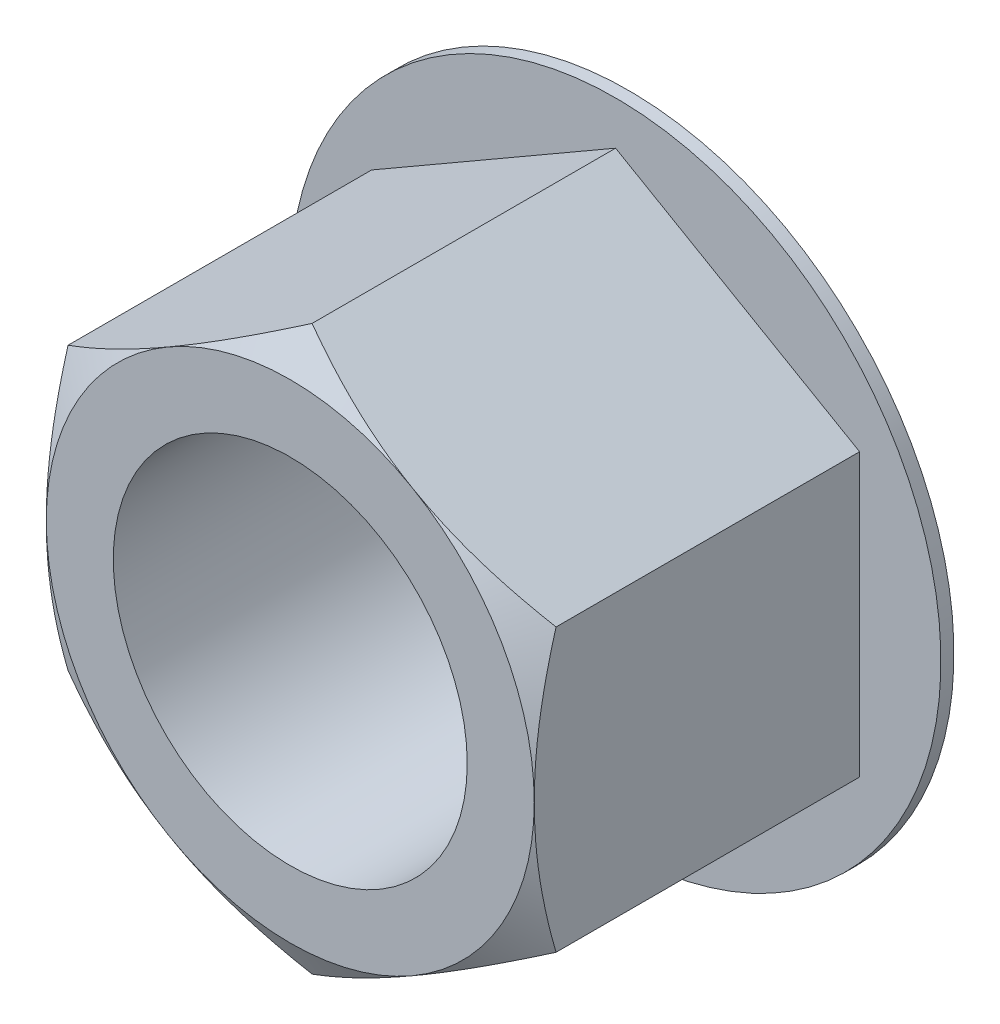
ISO-10303-21;
HEADER;
FILE_DESCRIPTION(('STEP AP214'),'2;1');
FILE_NAME('part.step','',(''),(''),'','','');
FILE_SCHEMA(('AUTOMOTIVE_DESIGN { 1 0 10303 214 1 1 1 1 }'));
ENDSEC;
DATA;
#1=APPLICATION_CONTEXT('core data for automotive mechanical design processes');
#2=APPLICATION_PROTOCOL_DEFINITION('international standard','automotive_design',2000,#1);
#3=PRODUCT_CONTEXT('',#1,'mechanical');
#4=PRODUCT('Part','Part','',(#3));
#5=PRODUCT_RELATED_PRODUCT_CATEGORY('part','',(#4));
#6=PRODUCT_DEFINITION_FORMATION('','',#4);
#7=PRODUCT_DEFINITION_CONTEXT('part definition',#1,'design');
#8=PRODUCT_DEFINITION('design','',#6,#7);
#9=PRODUCT_DEFINITION_SHAPE('','',#8);
#10=(LENGTH_UNIT() NAMED_UNIT(*) SI_UNIT(.MILLI.,.METRE.));
#11=(NAMED_UNIT(*) PLANE_ANGLE_UNIT() SI_UNIT($,.RADIAN.));
#12=(NAMED_UNIT(*) SI_UNIT($,.STERADIAN.) SOLID_ANGLE_UNIT());
#13=UNCERTAINTY_MEASURE_WITH_UNIT(LENGTH_MEASURE(1.E-05),#10,'distance_accuracy_value','');
#14=(GEOMETRIC_REPRESENTATION_CONTEXT(3) GLOBAL_UNCERTAINTY_ASSIGNED_CONTEXT((#13)) GLOBAL_UNIT_ASSIGNED_CONTEXT((#10,
#11,#12)) REPRESENTATION_CONTEXT('',''));
#15=CARTESIAN_POINT('',(0.,0.,0.));
#16=DIRECTION('',(0.,0.,1.));
#17=DIRECTION('',(1.,0.,0.));
#18=AXIS2_PLACEMENT_3D('',#15,#16,#17);
#19=CARTESIAN_POINT('',(0.,-5.49926131403119,3.302));
#20=DIRECTION('',(-0.5,0.866025403784439,0.));
#21=DIRECTION('',(-0.866025403784439,-0.5,0.));
#22=AXIS2_PLACEMENT_3D('',#19,#20,#21);
#23=PLANE('',#22);
#24=DIRECTION('',(-0.866025403784439,-0.5,0.));
#25=VECTOR('',#24,1.);
#26=CARTESIAN_POINT('',(0.,-5.49926131403119,-3.048));
#27=LINE('',#26,#25);
#28=CARTESIAN_POINT('',(4.7625,-2.7496306570156,-3.048));
#29=VERTEX_POINT('',#28);
#30=CARTESIAN_POINT('',(0.,-5.49926131403119,-3.048));
#31=VERTEX_POINT('',#30);
#32=EDGE_CURVE('E54',#29,#31,#27,.T.);
#33=ORIENTED_EDGE('',*,*,#32,.F.);
#34=DIRECTION('',(0.,0.,-1.));
#35=VECTOR('',#34,1.);
#36=CARTESIAN_POINT('',(4.7625,-2.7496306570156,3.302));
#37=LINE('',#36,#35);
#38=CARTESIAN_POINT('',(4.7625,-2.74963065701606,2.8766306570159));
#39=VERTEX_POINT('',#38);
#40=EDGE_CURVE('E350',#39,#29,#37,.T.);
#41=ORIENTED_EDGE('',*,*,#40,.F.);
#42=CARTESIAN_POINT('',(-0.000200000000001557,-5.49937678408502,2.87656398824923));
#43=CARTESIAN_POINT('',(0.209097361613877,-5.37853889601657,2.94634638758606));
#44=CARTESIAN_POINT('',(0.420184848381227,-5.25666747870888,3.00981673538478));
#45=CARTESIAN_POINT('',(0.846014990924113,-5.01081433128269,3.12060480393128));
#46=CARTESIAN_POINT('',(1.060765212584,-4.88682823299882,3.1678833345702));
#47=CARTESIAN_POINT('',(1.48763695593353,-4.64037371706653,3.24146647463121));
#48=CARTESIAN_POINT('',(1.69969199849541,-4.51794368116041,3.26826120779827));
#49=CARTESIAN_POINT('',(2.0185205060493,-4.33386795649885,3.29228887781912));
#50=CARTESIAN_POINT('',(2.12486940887228,-4.27246738882597,3.29760535899068));
#51=CARTESIAN_POINT('',(2.33766550248998,-4.1496095068933,3.30275983656829));
#52=CARTESIAN_POINT('',(2.44411269014726,-4.08815219444488,3.30259800219079));
#53=CARTESIAN_POINT('',(2.73574948805456,-3.91977561066751,3.29461505017809));
#54=CARTESIAN_POINT('',(2.92084246680697,-3.81291212955969,3.2812075795121));
#55=CARTESIAN_POINT('',(3.28979997894137,-3.59989441060936,3.23869213715631));
#56=CARTESIAN_POINT('',(3.47366321541067,-3.49374092153974,3.2095696317199));
#57=CARTESIAN_POINT('',(3.84336411079777,-3.28029401006835,3.1367707464131));
#58=CARTESIAN_POINT('',(4.02915510972679,-3.17302752682367,3.09278588695335));
#59=CARTESIAN_POINT('',(4.39796626900832,-2.96009430473234,2.99295772006117));
#60=CARTESIAN_POINT('',(4.58099115345591,-2.85442483842812,2.93713786532194));
#61=CARTESIAN_POINT('',(4.7627,-2.74951518696176,2.87656398824923));
#62=B_SPLINE_CURVE_WITH_KNOTS('',3,(#42,#43,#44,#45,#46,#47,#48,#49,#50,#51,#52,#53,#54,#55,#56,
#57,#58,#59,#60,#61),.UNSPECIFIED.,.F.,.F.,(4,2,2,2,2,2,2,2,2,4),(0.,0.754910190012917,
1.51163483480638,2.24963134670895,2.61827336240839,2.9869039913527,3.62867423192249,
4.27103902109236,4.92765153591996,5.58297484368455),.UNSPECIFIED.);
#63=CARTESIAN_POINT('',(2.38125,-4.12444598552339,3.302));
#64=VERTEX_POINT('',#63);
#65=EDGE_CURVE('E177',#64,#39,#62,.T.);
#66=ORIENTED_EDGE('',*,*,#65,.F.);
#67=CARTESIAN_POINT('',(0.,-5.49926131403119,2.87663065701559));
#68=VERTEX_POINT('',#67);
#69=EDGE_CURVE('E372',#68,#64,#62,.T.);
#70=ORIENTED_EDGE('',*,*,#69,.F.);
#71=DIRECTION('',(0.,0.,-1.));
#72=VECTOR('',#71,1.);
#73=CARTESIAN_POINT('',(0.,-5.49926131403119,3.302));
#74=LINE('',#73,#72);
#75=EDGE_CURVE('E123',#68,#31,#74,.T.);
#76=ORIENTED_EDGE('',*,*,#75,.T.);
#77=EDGE_LOOP('',(#33,#41,#66,#70,#76));
#78=FACE_BOUND('',#77,.T.);
#79=ADVANCED_FACE('F39',(#78),#23,.F.);
#80=CARTESIAN_POINT('',(4.7625,-2.7496306570156,3.302));
#81=DIRECTION('',(-1.,0.,0.));
#82=DIRECTION('',(0.,0.,1.));
#83=AXIS2_PLACEMENT_3D('',#80,#81,#82);
#84=PLANE('',#83);
#85=DIRECTION('',(0.,-1.,0.));
#86=VECTOR('',#85,1.);
#87=CARTESIAN_POINT('',(4.7625,-2.7496306570156,-3.048));
#88=LINE('',#87,#86);
#89=CARTESIAN_POINT('',(4.7625,2.7496306570156,-3.048));
#90=VERTEX_POINT('',#89);
#91=EDGE_CURVE('E61',#90,#29,#88,.T.);
#92=ORIENTED_EDGE('',*,*,#91,.F.);
#93=DIRECTION('',(0.,0.,-1.));
#94=VECTOR('',#93,1.);
#95=CARTESIAN_POINT('',(4.7625,2.7496306570156,3.302));
#96=LINE('',#95,#94);
#97=CARTESIAN_POINT('',(4.7625,2.7496306570156,2.87663065701559));
#98=VERTEX_POINT('',#97);
#99=EDGE_CURVE('E346',#98,#90,#96,.T.);
#100=ORIENTED_EDGE('',*,*,#99,.F.);
#101=CARTESIAN_POINT('',(4.7625,-7.43259464039858,0.955067457548677));
#102=CARTESIAN_POINT('',(4.7625,-7.22411450820325,1.05638612833359));
#103=CARTESIAN_POINT('',(4.7625,-7.01516063360966,1.15674645721878));
#104=CARTESIAN_POINT('',(4.7625,-6.59605349821596,1.35501210589177));
#105=CARTESIAN_POINT('',(4.7625,-6.38590005853444,1.45291704712989));
#106=CARTESIAN_POINT('',(4.7625,-5.96308230684034,1.64621576103325));
#107=CARTESIAN_POINT('',(4.7625,-5.75041058271418,1.74159337576871));
#108=CARTESIAN_POINT('',(4.7625,-5.3233910308401,1.92850508406923));
#109=CARTESIAN_POINT('',(4.7625,-5.10904328166222,2.02003935653927));
#110=CARTESIAN_POINT('',(4.7625,-4.67138779779958,2.20112340630176));
#111=CARTESIAN_POINT('',(4.7625,-4.44801391750027,2.290514178823));
#112=CARTESIAN_POINT('',(4.7625,-3.99867059158999,2.46264273248744));
#113=CARTESIAN_POINT('',(4.7625,-3.77270086072365,2.5453797743098));
#114=CARTESIAN_POINT('',(4.7625,-3.31821361285556,2.7020642302099));
#115=CARTESIAN_POINT('',(4.7625,-3.08970213881967,2.77602899913136));
#116=CARTESIAN_POINT('',(4.7625,-2.62940237063407,2.91282713665453));
#117=CARTESIAN_POINT('',(4.7625,-2.39761511725189,2.97566395858852));
#118=CARTESIAN_POINT('',(4.7625,-1.9318503723051,3.08690494123867));
#119=CARTESIAN_POINT('',(4.7625,-1.6978912145844,3.13538446433149));
#120=CARTESIAN_POINT('',(4.7625,-1.22701661073724,3.21517572349739));
#121=CARTESIAN_POINT('',(4.7625,-0.990101485772806,3.24648930829847));
#122=CARTESIAN_POINT('',(4.7625,-0.517610087229162,3.28904333598231));
#123=CARTESIAN_POINT('',(4.7625,-0.282057977065897,3.30054545366036));
#124=CARTESIAN_POINT('',(4.7625,0.189186255989509,3.30319314897739));
#125=CARTESIAN_POINT('',(4.7625,0.424878383335705,3.29433804007255));
#126=CARTESIAN_POINT('',(4.7625,0.823513817362239,3.26277565833861));
#127=CARTESIAN_POINT('',(4.7625,0.986878614286651,3.24507383430558));
#128=CARTESIAN_POINT('',(4.7625,1.31243667370343,3.20096567046441));
#129=CARTESIAN_POINT('',(4.7625,1.47462978062366,3.17455819570085));
#130=CARTESIAN_POINT('',(4.7625,1.95921005512047,3.08366325636657));
#131=CARTESIAN_POINT('',(4.7625,2.27943615858163,3.0075178281031));
#132=CARTESIAN_POINT('',(4.7625,2.75857061694519,2.87511257683219));
#133=CARTESIAN_POINT('',(4.7625,2.91994890998381,2.82727970687735));
#134=CARTESIAN_POINT('',(4.7625,3.2411372584468,2.72656413243814));
#135=CARTESIAN_POINT('',(4.7625,3.40094730115089,2.67368138703084));
#136=CARTESIAN_POINT('',(4.7625,3.71905283914853,2.56372171403105));
#137=CARTESIAN_POINT('',(4.7625,3.87734875885308,2.50664600313531));
#138=CARTESIAN_POINT('',(4.7625,4.19261940138209,2.38898021325608));
#139=CARTESIAN_POINT('',(4.7625,4.34959416247374,2.32839023646679));
#140=CARTESIAN_POINT('',(4.7625,4.80367468684097,2.14822352017069));
#141=CARTESIAN_POINT('',(4.7625,5.0992569562043,2.02480956683074));
#142=CARTESIAN_POINT('',(4.7625,5.68714518287288,1.770381451221));
#143=CARTESIAN_POINT('',(4.7625,5.97945067529777,1.63936622643264));
#144=CARTESIAN_POINT('',(4.7625,6.56162440695187,1.3716971642375));
#145=CARTESIAN_POINT('',(4.7625,6.85149144666802,1.23504072712371));
#146=CARTESIAN_POINT('',(4.7625,7.4291964194678,0.957558467654938));
#147=CARTESIAN_POINT('',(4.7625,7.71703445935483,0.816732866818255));
#148=CARTESIAN_POINT('',(4.7625,8.29164575367581,0.53163084716088));
#149=CARTESIAN_POINT('',(4.7625,8.57841611781564,0.387348615782889));
#150=CARTESIAN_POINT('',(4.7625,9.15069044695171,0.0962907223958888));
#151=CARTESIAN_POINT('',(4.7625,9.4361943978734,-0.0504849672375805));
#152=CARTESIAN_POINT('',(4.7625,10.0061024894397,-0.345967491969973));
#153=CARTESIAN_POINT('',(4.7625,10.2905069054268,-0.494673796644888));
#154=CARTESIAN_POINT('',(4.7625,10.8584819419315,-0.793671144311453));
#155=CARTESIAN_POINT('',(4.7625,11.1420525593858,-0.943962193115665));
#156=CARTESIAN_POINT('',(4.7625,11.9248093753329,-1.36109208732939));
#157=CARTESIAN_POINT('',(4.7625,12.4232742309595,-1.62928417699878));
#158=CARTESIAN_POINT('',(4.7625,13.4186968251918,-2.16853511257942));
#159=CARTESIAN_POINT('',(4.7625,13.915654445862,-2.43959417573528));
#160=CARTESIAN_POINT('',(4.7625,14.9066230802734,-2.98283334400776));
#161=CARTESIAN_POINT('',(4.7625,15.4006382542629,-3.25500586681001));
#162=CARTESIAN_POINT('',(4.7625,16.3877299407623,-3.80094276621926));
#163=CARTESIAN_POINT('',(4.7625,16.8808065345003,-4.07470699590537));
#164=CARTESIAN_POINT('',(4.7625,17.3735623145606,-4.34904357990959));
#165=B_SPLINE_CURVE_WITH_KNOTS('',3,(#101,#102,#103,#104,#105,#106,#107,#108,#109,#110,#111,
#112,#113,#114,#115,#116,#117,#118,#119,#120,#121,#122,#123,#124,#125,#126,#127,#128,#129,#130,
#131,#132,#133,#134,#135,#136,#137,#138,#139,#140,#141,#142,#143,#144,#145,#146,#147,#148,#149,
#150,#151,#152,#153,#154,#155,#156,#157,#158,#159,#160,#161,#162,#163,#164),.UNSPECIFIED.,.F.,
.F.,(4,2,2,2,2,2,2,2,2,2,2,2,2,2,2,2,2,2,2,2,2,2,2,2,2,2,2,2,2,2,2,4),(0.,0.695396628956614,
1.39089981695892,2.09010847744957,2.78928455408388,3.51099163225711,4.23277879151547,
4.95311328448396,5.67322384305055,6.3894846262927,7.10566825490353,7.81231766773407,
8.51899091253915,9.01171631420671,9.50450597788894,10.4905710961279,10.9954807941976,
11.5003945842771,12.0051624349957,12.5099156145111,13.4706831639079,14.4315853360982,
15.3929353869884,16.3542344502484,17.3172825999118,18.2803414259346,19.2431410334047,
20.2059441734829,21.9040307326758,23.6022468993999,25.2943309147211,26.9862611479808),.UNSPECIFIED.);
#166=CARTESIAN_POINT('',(4.7625,0.,3.302));
#167=VERTEX_POINT('',#166);
#168=EDGE_CURVE('E202',#167,#98,#165,.T.);
#169=ORIENTED_EDGE('',*,*,#168,.F.);
#170=EDGE_CURVE('E373',#39,#167,#165,.T.);
#171=ORIENTED_EDGE('',*,*,#170,.F.);
#172=ORIENTED_EDGE('',*,*,#40,.T.);
#173=EDGE_LOOP('',(#92,#100,#169,#171,#172));
#174=FACE_BOUND('',#173,.T.);
#175=ADVANCED_FACE('F211',(#174),#84,.F.);
#176=CARTESIAN_POINT('',(4.7625,2.7496306570156,3.302));
#177=DIRECTION('',(-0.5,-0.866025403784439,0.));
#178=DIRECTION('',(0.866025403784439,-0.5,0.));
#179=AXIS2_PLACEMENT_3D('',#176,#177,#178);
#180=PLANE('',#179);
#181=DIRECTION('',(0.866025403784439,-0.5,0.));
#182=VECTOR('',#181,1.);
#183=CARTESIAN_POINT('',(4.7625,2.7496306570156,-3.048));
#184=LINE('',#183,#182);
#185=CARTESIAN_POINT('',(0.,5.49926131403119,-3.048));
#186=VERTEX_POINT('',#185);
#187=EDGE_CURVE('E143',#186,#90,#184,.T.);
#188=ORIENTED_EDGE('',*,*,#187,.F.);
#189=DIRECTION('',(0.,0.,-1.));
#190=VECTOR('',#189,1.);
#191=CARTESIAN_POINT('',(0.,5.49926131403119,3.302));
#192=LINE('',#191,#190);
#193=CARTESIAN_POINT('',(0.,5.49926131403119,2.87663065701559));
#194=VERTEX_POINT('',#193);
#195=EDGE_CURVE('E344',#194,#186,#192,.T.);
#196=ORIENTED_EDGE('',*,*,#195,.F.);
#197=CARTESIAN_POINT('',(4.7627,2.74951518696176,2.87656398824923));
#198=CARTESIAN_POINT('',(4.55340263838612,2.87035307503021,2.94634638758606));
#199=CARTESIAN_POINT('',(4.34231515161877,2.9922244923379,3.00981673538478));
#200=CARTESIAN_POINT('',(3.91648500907588,3.23807763976409,3.12060480393128));
#201=CARTESIAN_POINT('',(3.701734787416,3.36206373804796,3.1678833345702));
#202=CARTESIAN_POINT('',(3.27486304406647,3.60851825398025,3.24146647463121));
#203=CARTESIAN_POINT('',(3.06280800150458,3.73094828988638,3.26826120779827));
#204=CARTESIAN_POINT('',(2.7439794939507,3.91502401454794,3.29228887781912));
#205=CARTESIAN_POINT('',(2.63763059112772,3.97642458222081,3.29760535899068));
#206=CARTESIAN_POINT('',(2.42483449751002,4.09928246415349,3.30275983656829));
#207=CARTESIAN_POINT('',(2.31838730985274,4.1607397766019,3.30259800219079));
#208=CARTESIAN_POINT('',(2.02675051194544,4.32911636037928,3.29461505017809));
#209=CARTESIAN_POINT('',(1.84165753319303,4.43597984148709,3.2812075795121));
#210=CARTESIAN_POINT('',(1.47270002105863,4.64899756043742,3.23869213715631));
#211=CARTESIAN_POINT('',(1.28883678458933,4.75515104950705,3.2095696317199));
#212=CARTESIAN_POINT('',(0.919135889202232,4.96859796097843,3.1367707464131));
#213=CARTESIAN_POINT('',(0.733344890273213,5.07586444422311,3.09278588695335));
#214=CARTESIAN_POINT('',(0.364533730991679,5.28879766631444,2.99295772006117));
#215=CARTESIAN_POINT('',(0.181508846544093,5.39446713261866,2.93713786532194));
#216=CARTESIAN_POINT('',(-0.000199999999998554,5.49937678408502,2.87656398824923));
#217=B_SPLINE_CURVE_WITH_KNOTS('',3,(#197,#198,#199,#200,#201,#202,#203,#204,#205,#206,#207,
#208,#209,#210,#211,#212,#213,#214,#215,#216),.UNSPECIFIED.,.F.,.F.,(4,2,2,2,2,2,2,2,2,4),(0.,
0.754910190012917,1.51163483480638,2.24963134670895,2.61827336240839,2.9869039913527,
3.6286742319225,4.27103902109236,4.92765153591996,5.58297484368455),.UNSPECIFIED.);
#218=CARTESIAN_POINT('',(2.38125,4.12444598552339,3.302));
#219=VERTEX_POINT('',#218);
#220=EDGE_CURVE('E194',#219,#194,#217,.T.);
#221=ORIENTED_EDGE('',*,*,#220,.F.);
#222=EDGE_CURVE('E200',#98,#219,#217,.T.);
#223=ORIENTED_EDGE('',*,*,#222,.F.);
#224=ORIENTED_EDGE('',*,*,#99,.T.);
#225=EDGE_LOOP('',(#188,#196,#221,#223,#224));
#226=FACE_BOUND('',#225,.T.);
#227=ADVANCED_FACE('F207',(#226),#180,.F.);
#228=CARTESIAN_POINT('',(0.,5.49926131403119,3.302));
#229=DIRECTION('',(0.5,-0.866025403784439,0.));
#230=DIRECTION('',(0.866025403784439,0.5,0.));
#231=AXIS2_PLACEMENT_3D('',#228,#229,#230);
#232=PLANE('',#231);
#233=DIRECTION('',(0.866025403784439,0.5,0.));
#234=VECTOR('',#233,1.);
#235=CARTESIAN_POINT('',(0.,5.49926131403119,-3.048));
#236=LINE('',#235,#234);
#237=CARTESIAN_POINT('',(-4.7625,2.74963065701559,-3.048));
#238=VERTEX_POINT('',#237);
#239=EDGE_CURVE('E133',#238,#186,#236,.T.);
#240=ORIENTED_EDGE('',*,*,#239,.F.);
#241=DIRECTION('',(0.,0.,-1.));
#242=VECTOR('',#241,1.);
#243=CARTESIAN_POINT('',(-4.7625,2.74963065701559,3.302));
#244=LINE('',#243,#242);
#245=CARTESIAN_POINT('',(-4.7625,2.74963065701559,2.87663065701559));
#246=VERTEX_POINT('',#245);
#247=EDGE_CURVE('E122',#246,#238,#244,.T.);
#248=ORIENTED_EDGE('',*,*,#247,.F.);
#249=CARTESIAN_POINT('',(0.000200000000001122,5.49937678408503,2.87656398824923));
#250=CARTESIAN_POINT('',(-0.209097361613877,5.37853889601657,2.94634638758605));
#251=CARTESIAN_POINT('',(-0.420184848381227,5.25666747870888,3.00981673538478));
#252=CARTESIAN_POINT('',(-0.846014990924114,5.01081433128269,3.12060480393128));
#253=CARTESIAN_POINT('',(-1.060765212584,4.88682823299882,3.1678833345702));
#254=CARTESIAN_POINT('',(-1.48763695593353,4.64037371706653,3.24146647463121));
#255=CARTESIAN_POINT('',(-1.69969199849541,4.51794368116041,3.26826120779827));
#256=CARTESIAN_POINT('',(-2.0185205060493,4.33386795649885,3.29228887781912));
#257=CARTESIAN_POINT('',(-2.12486940887228,4.27246738882597,3.29760535899068));
#258=CARTESIAN_POINT('',(-2.33766550248998,4.1496095068933,3.30275983656829));
#259=CARTESIAN_POINT('',(-2.44411269014726,4.08815219444489,3.30259800219079));
#260=CARTESIAN_POINT('',(-2.73574948805456,3.91977561066751,3.29461505017809));
#261=CARTESIAN_POINT('',(-2.92084246680697,3.81291212955969,3.2812075795121));
#262=CARTESIAN_POINT('',(-3.28979997894137,3.59989441060936,3.23869213715631));
#263=CARTESIAN_POINT('',(-3.47366321541067,3.49374092153974,3.2095696317199));
#264=CARTESIAN_POINT('',(-3.84336411079777,3.28029401006835,3.1367707464131));
#265=CARTESIAN_POINT('',(-4.02915510972679,3.17302752682367,3.09278588695335));
#266=CARTESIAN_POINT('',(-4.39796626900832,2.96009430473234,2.99295772006117));
#267=CARTESIAN_POINT('',(-4.58099115345591,2.85442483842812,2.93713786532194));
#268=CARTESIAN_POINT('',(-4.7627,2.74951518696176,2.87656398824923));
#269=B_SPLINE_CURVE_WITH_KNOTS('',3,(#249,#250,#251,#252,#253,#254,#255,#256,#257,#258,#259,
#260,#261,#262,#263,#264,#265,#266,#267,#268),.UNSPECIFIED.,.F.,.F.,(4,2,2,2,2,2,2,2,2,4),(0.,
0.754910190012917,1.51163483480638,2.24963134670895,2.61827336240839,2.9869039913527,
3.6286742319225,4.27103902109237,4.92765153591996,5.58297484368455),.UNSPECIFIED.);
#270=CARTESIAN_POINT('',(-2.38125,4.12444598552339,3.302));
#271=VERTEX_POINT('',#270);
#272=EDGE_CURVE('E187',#271,#246,#269,.T.);
#273=ORIENTED_EDGE('',*,*,#272,.F.);
#274=EDGE_CURVE('E201',#194,#271,#269,.T.);
#275=ORIENTED_EDGE('',*,*,#274,.F.);
#276=ORIENTED_EDGE('',*,*,#195,.T.);
#277=EDGE_LOOP('',(#240,#248,#273,#275,#276));
#278=FACE_BOUND('',#277,.T.);
#279=ADVANCED_FACE('F210',(#278),#232,.F.);
#280=CARTESIAN_POINT('',(-4.7625,2.74963065701559,3.302));
#281=DIRECTION('',(1.,0.,0.));
#282=DIRECTION('',(0.,0.,-1.));
#283=AXIS2_PLACEMENT_3D('',#280,#281,#282);
#284=PLANE('',#283);
#285=DIRECTION('',(0.,1.,0.));
#286=VECTOR('',#285,1.);
#287=CARTESIAN_POINT('',(-4.7625,2.74963065701559,-3.048));
#288=LINE('',#287,#286);
#289=CARTESIAN_POINT('',(-4.7625,-2.74963065701559,-3.048));
#290=VERTEX_POINT('',#289);
#291=EDGE_CURVE('E127',#290,#238,#288,.T.);
#292=ORIENTED_EDGE('',*,*,#291,.F.);
#293=DIRECTION('',(0.,0.,-1.));
#294=VECTOR('',#293,1.);
#295=CARTESIAN_POINT('',(-4.7625,-2.74963065701559,3.302));
#296=LINE('',#295,#294);
#297=CARTESIAN_POINT('',(-4.7625,-2.74963065701559,2.87663065701559));
#298=VERTEX_POINT('',#297);
#299=EDGE_CURVE('E113',#298,#290,#296,.T.);
#300=ORIENTED_EDGE('',*,*,#299,.F.);
#301=CARTESIAN_POINT('',(-4.7625,-7.43259464039858,0.955067457548677));
#302=CARTESIAN_POINT('',(-4.7625,-7.22411450820325,1.05638612833359));
#303=CARTESIAN_POINT('',(-4.7625,-7.01516063360966,1.15674645721878));
#304=CARTESIAN_POINT('',(-4.7625,-6.59605349821596,1.35501210589177));
#305=CARTESIAN_POINT('',(-4.7625,-6.38590005853444,1.45291704712989));
#306=CARTESIAN_POINT('',(-4.7625,-5.96308230684034,1.64621576103325));
#307=CARTESIAN_POINT('',(-4.7625,-5.75041058271418,1.74159337576871));
#308=CARTESIAN_POINT('',(-4.7625,-5.3233910308401,1.92850508406923));
#309=CARTESIAN_POINT('',(-4.7625,-5.10904328166222,2.02003935653927));
#310=CARTESIAN_POINT('',(-4.7625,-4.67138779779958,2.20112340630176));
#311=CARTESIAN_POINT('',(-4.7625,-4.44801391750027,2.290514178823));
#312=CARTESIAN_POINT('',(-4.7625,-3.99867059158999,2.46264273248744));
#313=CARTESIAN_POINT('',(-4.7625,-3.77270086072364,2.5453797743098));
#314=CARTESIAN_POINT('',(-4.7625,-3.31821361285556,2.7020642302099));
#315=CARTESIAN_POINT('',(-4.7625,-3.08970213881967,2.77602899913136));
#316=CARTESIAN_POINT('',(-4.7625,-2.62940237063407,2.91282713665453));
#317=CARTESIAN_POINT('',(-4.7625,-2.39761511725189,2.97566395858852));
#318=CARTESIAN_POINT('',(-4.7625,-1.93185037230509,3.08690494123867));
#319=CARTESIAN_POINT('',(-4.7625,-1.6978912145844,3.13538446433149));
#320=CARTESIAN_POINT('',(-4.7625,-1.22701661073724,3.21517572349739));
#321=CARTESIAN_POINT('',(-4.7625,-0.990101485772805,3.24648930829847));
#322=CARTESIAN_POINT('',(-4.7625,-0.517610087229161,3.28904333598231));
#323=CARTESIAN_POINT('',(-4.7625,-0.282057977065895,3.30054545366036));
#324=CARTESIAN_POINT('',(-4.7625,0.18918625598951,3.30319314897738));
#325=CARTESIAN_POINT('',(-4.7625,0.424878383335707,3.29433804007254));
#326=CARTESIAN_POINT('',(-4.7625,0.823513817362241,3.2627756583386));
#327=CARTESIAN_POINT('',(-4.7625,0.986878614286653,3.24507383430558));
#328=CARTESIAN_POINT('',(-4.7625,1.31243667370344,3.20096567046441));
#329=CARTESIAN_POINT('',(-4.7625,1.47462978062366,3.17455819570085));
#330=CARTESIAN_POINT('',(-4.7625,1.95921005512047,3.08366325636657));
#331=CARTESIAN_POINT('',(-4.7625,2.27943615858163,3.0075178281031));
#332=CARTESIAN_POINT('',(-4.7625,2.75857061694519,2.87511257683219));
#333=CARTESIAN_POINT('',(-4.7625,2.91994890998381,2.82727970687734));
#334=CARTESIAN_POINT('',(-4.7625,3.24113725844681,2.72656413243814));
#335=CARTESIAN_POINT('',(-4.7625,3.4009473011509,2.67368138703084));
#336=CARTESIAN_POINT('',(-4.7625,3.71905283914853,2.56372171403105));
#337=CARTESIAN_POINT('',(-4.7625,3.87734875885308,2.50664600313531));
#338=CARTESIAN_POINT('',(-4.7625,4.19261940138209,2.38898021325608));
#339=CARTESIAN_POINT('',(-4.7625,4.34959416247374,2.32839023646679));
#340=CARTESIAN_POINT('',(-4.7625,4.80367468684098,2.14822352017069));
#341=CARTESIAN_POINT('',(-4.7625,5.0992569562043,2.02480956683074));
#342=CARTESIAN_POINT('',(-4.7625,5.68714518287288,1.770381451221));
#343=CARTESIAN_POINT('',(-4.7625,5.97945067529777,1.63936622643264));
#344=CARTESIAN_POINT('',(-4.7625,6.56162440695187,1.3716971642375));
#345=CARTESIAN_POINT('',(-4.7625,6.85149144666802,1.23504072712371));
#346=CARTESIAN_POINT('',(-4.7625,7.4291964194678,0.957558467654938));
#347=CARTESIAN_POINT('',(-4.7625,7.71703445935483,0.816732866818255));
#348=CARTESIAN_POINT('',(-4.7625,8.29164575367581,0.531630847160881));
#349=CARTESIAN_POINT('',(-4.7625,8.57841611781564,0.387348615782891));
#350=CARTESIAN_POINT('',(-4.7625,9.15069044695171,0.0962907223958911));
#351=CARTESIAN_POINT('',(-4.7625,9.43619439787339,-0.0504849672375782));
#352=CARTESIAN_POINT('',(-4.7625,10.0061024894397,-0.345967491969971));
#353=CARTESIAN_POINT('',(-4.7625,10.2905069054268,-0.494673796644885));
#354=CARTESIAN_POINT('',(-4.7625,10.8584819419314,-0.79367114431145));
#355=CARTESIAN_POINT('',(-4.7625,11.1420525593858,-0.943962193115661));
#356=CARTESIAN_POINT('',(-4.7625,11.9248093753329,-1.36109208732939));
#357=CARTESIAN_POINT('',(-4.7625,12.4232742309595,-1.62928417699877));
#358=CARTESIAN_POINT('',(-4.7625,13.4186968251918,-2.16853511257942));
#359=CARTESIAN_POINT('',(-4.7625,13.915654445862,-2.43959417573528));
#360=CARTESIAN_POINT('',(-4.7625,14.9066230802734,-2.98283334400776));
#361=CARTESIAN_POINT('',(-4.7625,15.4006382542629,-3.25500586681));
#362=CARTESIAN_POINT('',(-4.7625,16.3877299407623,-3.80094276621926));
#363=CARTESIAN_POINT('',(-4.7625,16.8808065345003,-4.07470699590537));
#364=CARTESIAN_POINT('',(-4.7625,17.3735623145606,-4.34904357990959));
#365=B_SPLINE_CURVE_WITH_KNOTS('',3,(#301,#302,#303,#304,#305,#306,#307,#308,#309,#310,#311,
#312,#313,#314,#315,#316,#317,#318,#319,#320,#321,#322,#323,#324,#325,#326,#327,#328,#329,#330,
#331,#332,#333,#334,#335,#336,#337,#338,#339,#340,#341,#342,#343,#344,#345,#346,#347,#348,#349,
#350,#351,#352,#353,#354,#355,#356,#357,#358,#359,#360,#361,#362,#363,#364),.UNSPECIFIED.,.F.,
.F.,(4,2,2,2,2,2,2,2,2,2,2,2,2,2,2,2,2,2,2,2,2,2,2,2,2,2,2,2,2,2,2,4),(0.,0.695396628956612,
1.39089981695892,2.09010847744957,2.78928455408388,3.51099163225712,4.23277879151548,
4.95311328448396,5.67322384305056,6.3894846262927,7.10566825490354,7.81231766773407,
8.51899091253916,9.01171631420672,9.50450597788894,10.4905710961279,10.9954807941976,
11.5003945842771,12.0051624349957,12.5099156145111,13.4706831639079,14.4315853360982,
15.3929353869884,16.3542344502484,17.3172825999118,18.2803414259346,19.2431410334047,
20.2059441734829,21.9040307326758,23.6022468993999,25.2943309147211,26.9862611479808),.UNSPECIFIED.);
#366=CARTESIAN_POINT('',(-4.7625,0.,3.302));
#367=VERTEX_POINT('',#366);
#368=EDGE_CURVE('E154',#367,#298,#365,.F.);
#369=ORIENTED_EDGE('',*,*,#368,.F.);
#370=EDGE_CURVE('E382',#246,#367,#365,.F.);
#371=ORIENTED_EDGE('',*,*,#370,.F.);
#372=ORIENTED_EDGE('',*,*,#247,.T.);
#373=EDGE_LOOP('',(#292,#300,#369,#371,#372));
#374=FACE_BOUND('',#373,.T.);
#375=ADVANCED_FACE('F128',(#374),#284,.F.);
#376=CARTESIAN_POINT('',(-4.7625,-2.74963065701559,3.302));
#377=DIRECTION('',(0.5,0.866025403784439,0.));
#378=DIRECTION('',(-0.866025403784439,0.5,0.));
#379=AXIS2_PLACEMENT_3D('',#376,#377,#378);
#380=PLANE('',#379);
#381=DIRECTION('',(-0.866025403784439,0.5,0.));
#382=VECTOR('',#381,1.);
#383=CARTESIAN_POINT('',(-4.7625,-2.74963065701559,-3.048));
#384=LINE('',#383,#382);
#385=EDGE_CURVE('E12',#31,#290,#384,.T.);
#386=ORIENTED_EDGE('',*,*,#385,.F.);
#387=ORIENTED_EDGE('',*,*,#75,.F.);
#388=CARTESIAN_POINT('',(-4.7627,-2.74951518696176,2.87656398824923));
#389=CARTESIAN_POINT('',(-4.55340263838612,-2.87035307503021,2.94634638758605));
#390=CARTESIAN_POINT('',(-4.34231515161877,-2.9922244923379,3.00981673538478));
#391=CARTESIAN_POINT('',(-3.91648500907589,-3.23807763976409,3.12060480393128));
#392=CARTESIAN_POINT('',(-3.701734787416,-3.36206373804796,3.1678833345702));
#393=CARTESIAN_POINT('',(-3.27486304406647,-3.60851825398025,3.24146647463121));
#394=CARTESIAN_POINT('',(-3.06280800150459,-3.73094828988637,3.26826120779827));
#395=CARTESIAN_POINT('',(-2.7439794939507,-3.91502401454794,3.29228887781912));
#396=CARTESIAN_POINT('',(-2.63763059112772,-3.97642458222081,3.29760535899068));
#397=CARTESIAN_POINT('',(-2.42483449751002,-4.09928246415348,3.30275983656829));
#398=CARTESIAN_POINT('',(-2.31838730985274,-4.1607397766019,3.30259800219079));
#399=CARTESIAN_POINT('',(-2.02675051194544,-4.32911636037927,3.29461505017809));
#400=CARTESIAN_POINT('',(-1.84165753319303,-4.43597984148709,3.28120757951211));
#401=CARTESIAN_POINT('',(-1.47270002105863,-4.64899756043742,3.23869213715631));
#402=CARTESIAN_POINT('',(-1.28883678458933,-4.75515104950704,3.2095696317199));
#403=CARTESIAN_POINT('',(-0.919135889202233,-4.96859796097843,3.1367707464131));
#404=CARTESIAN_POINT('',(-0.733344890273213,-5.07586444422311,3.09278588695335));
#405=CARTESIAN_POINT('',(-0.364533730991679,-5.28879766631444,2.99295772006117));
#406=CARTESIAN_POINT('',(-0.181508846544093,-5.39446713261866,2.93713786532195));
#407=CARTESIAN_POINT('',(0.00019999999999843,-5.49937678408502,2.87656398824923));
#408=B_SPLINE_CURVE_WITH_KNOTS('',3,(#388,#389,#390,#391,#392,#393,#394,#395,#396,#397,#398,
#399,#400,#401,#402,#403,#404,#405,#406,#407),.UNSPECIFIED.,.F.,.F.,(4,2,2,2,2,2,2,2,2,4),(0.,
0.754910190012917,1.51163483480638,2.24963134670895,2.61827336240839,2.9869039913527,
3.6286742319225,4.27103902109237,4.92765153591996,5.58297484368455),.UNSPECIFIED.);
#409=CARTESIAN_POINT('',(-2.38125,-4.12444598552339,3.302));
#410=VERTEX_POINT('',#409);
#411=EDGE_CURVE('E141',#410,#68,#408,.T.);
#412=ORIENTED_EDGE('',*,*,#411,.F.);
#413=EDGE_CURVE('E119',#298,#410,#408,.T.);
#414=ORIENTED_EDGE('',*,*,#413,.F.);
#415=ORIENTED_EDGE('',*,*,#299,.T.);
#416=EDGE_LOOP('',(#386,#387,#412,#414,#415));
#417=FACE_BOUND('',#416,.T.);
#418=ADVANCED_FACE('F115',(#417),#380,.F.);
#419=CARTESIAN_POINT('',(0.,0.,3.302));
#420=DIRECTION('',(0.,0.,-1.));
#421=DIRECTION('',(1.,0.,0.));
#422=AXIS2_PLACEMENT_3D('',#419,#420,#421);
#423=CONICAL_SURFACE('',#422,4.7625,1.0471975511966);
#424=ORIENTED_EDGE('',*,*,#65,.T.);
#425=ORIENTED_EDGE('',*,*,#170,.T.);
#426=CARTESIAN_POINT('',(0.,0.,3.302));
#427=DIRECTION('',(0.,0.,1.));
#428=DIRECTION('',(1.,0.,0.));
#429=AXIS2_PLACEMENT_3D('',#426,#427,#428);
#430=CIRCLE('',#429,4.7625);
#431=EDGE_CURVE('E354',#64,#167,#430,.T.);
#432=ORIENTED_EDGE('',*,*,#431,.F.);
#433=EDGE_LOOP('',(#424,#425,#432));
#434=FACE_BOUND('',#433,.T.);
#435=ADVANCED_FACE('F169',(#434),#423,.T.);
#436=ORIENTED_EDGE('',*,*,#69,.T.);
#437=EDGE_CURVE('E356',#410,#64,#430,.T.);
#438=ORIENTED_EDGE('',*,*,#437,.F.);
#439=ORIENTED_EDGE('',*,*,#411,.T.);
#440=EDGE_LOOP('',(#436,#438,#439));
#441=FACE_BOUND('',#440,.T.);
#442=ADVANCED_FACE('F163',(#441),#423,.T.);
#443=ORIENTED_EDGE('',*,*,#368,.T.);
#444=ORIENTED_EDGE('',*,*,#413,.T.);
#445=EDGE_CURVE('E361',#367,#410,#430,.T.);
#446=ORIENTED_EDGE('',*,*,#445,.F.);
#447=EDGE_LOOP('',(#443,#444,#446));
#448=FACE_BOUND('',#447,.T.);
#449=ADVANCED_FACE('F168',(#448),#423,.T.);
#450=ORIENTED_EDGE('',*,*,#272,.T.);
#451=ORIENTED_EDGE('',*,*,#370,.T.);
#452=EDGE_CURVE('E363',#271,#367,#430,.T.);
#453=ORIENTED_EDGE('',*,*,#452,.F.);
#454=EDGE_LOOP('',(#450,#451,#453));
#455=FACE_BOUND('',#454,.T.);
#456=ADVANCED_FACE('F381',(#455),#423,.T.);
#457=ORIENTED_EDGE('',*,*,#220,.T.);
#458=ORIENTED_EDGE('',*,*,#274,.T.);
#459=EDGE_CURVE('E47',#219,#271,#430,.T.);
#460=ORIENTED_EDGE('',*,*,#459,.F.);
#461=EDGE_LOOP('',(#457,#458,#460));
#462=FACE_BOUND('',#461,.T.);
#463=ADVANCED_FACE('F379',(#462),#423,.T.);
#464=ORIENTED_EDGE('',*,*,#168,.T.);
#465=ORIENTED_EDGE('',*,*,#222,.T.);
#466=CARTESIAN_POINT('',(0.,0.,3.302));
#467=DIRECTION('',(0.,0.,1.));
#468=DIRECTION('',(1.,0.,0.));
#469=AXIS2_PLACEMENT_3D('',#466,#467,#468);
#470=CIRCLE('',#469,4.7625);
#471=EDGE_CURVE('E138',#167,#219,#470,.T.);
#472=ORIENTED_EDGE('',*,*,#471,.F.);
#473=EDGE_LOOP('',(#464,#465,#472));
#474=FACE_BOUND('',#473,.T.);
#475=ADVANCED_FACE('F228',(#474),#423,.T.);
#476=CARTESIAN_POINT('',(4.7625,-2.7496306570156,3.302));
#477=DIRECTION('',(0.,0.,1.));
#478=DIRECTION('',(1.,0.,0.));
#479=AXIS2_PLACEMENT_3D('',#476,#477,#478);
#480=PLANE('',#479);
#481=CARTESIAN_POINT('',(0.,0.,3.302));
#482=DIRECTION('',(0.,0.,1.));
#483=DIRECTION('',(1.,0.,0.));
#484=AXIS2_PLACEMENT_3D('',#481,#482,#483);
#485=CIRCLE('',#484,3.4544);
#486=CARTESIAN_POINT('',(3.4544,0.,3.302));
#487=VERTEX_POINT('',#486);
#488=EDGE_CURVE('E332',#487,#487,#485,.T.);
#489=ORIENTED_EDGE('',*,*,#488,.F.);
#490=EDGE_LOOP('',(#489));
#491=FACE_BOUND('',#490,.T.);
#492=ORIENTED_EDGE('',*,*,#431,.T.);
#493=ORIENTED_EDGE('',*,*,#471,.T.);
#494=ORIENTED_EDGE('',*,*,#459,.T.);
#495=ORIENTED_EDGE('',*,*,#452,.T.);
#496=ORIENTED_EDGE('',*,*,#445,.T.);
#497=ORIENTED_EDGE('',*,*,#437,.T.);
#498=EDGE_LOOP('',(#492,#493,#494,#495,#496,#497));
#499=FACE_BOUND('',#498,.T.);
#500=ADVANCED_FACE('F173',(#491,#499),#480,.T.);
#501=CARTESIAN_POINT('',(0.,0.,-3.048));
#502=DIRECTION('',(0.,0.,-1.));
#503=DIRECTION('',(-1.,0.,0.));
#504=AXIS2_PLACEMENT_3D('',#501,#502,#503);
#505=PLANE('',#504);
#506=CARTESIAN_POINT('',(0.,0.,-3.048));
#507=DIRECTION('',(0.,0.,-1.));
#508=DIRECTION('',(-1.,0.,0.));
#509=AXIS2_PLACEMENT_3D('',#506,#507,#508);
#510=CIRCLE('',#509,6.35);
#511=CARTESIAN_POINT('',(-6.35,0.,-3.048));
#512=VERTEX_POINT('',#511);
#513=EDGE_CURVE('E134',#512,#512,#510,.T.);
#514=ORIENTED_EDGE('',*,*,#513,.F.);
#515=EDGE_LOOP('',(#514));
#516=FACE_BOUND('',#515,.T.);
#517=ORIENTED_EDGE('',*,*,#91,.T.);
#518=ORIENTED_EDGE('',*,*,#32,.T.);
#519=ORIENTED_EDGE('',*,*,#385,.T.);
#520=ORIENTED_EDGE('',*,*,#291,.T.);
#521=ORIENTED_EDGE('',*,*,#239,.T.);
#522=ORIENTED_EDGE('',*,*,#187,.T.);
#523=EDGE_LOOP('',(#517,#518,#519,#520,#521,#522));
#524=FACE_BOUND('',#523,.T.);
#525=ADVANCED_FACE('F136',(#516,#524),#505,.F.);
#526=CARTESIAN_POINT('',(0.,0.,-3.048));
#527=DIRECTION('',(0.,0.,-1.));
#528=DIRECTION('',(-1.,0.,0.));
#529=AXIS2_PLACEMENT_3D('',#526,#527,#528);
#530=CYLINDRICAL_SURFACE('',#529,6.35);
#531=ORIENTED_EDGE('',*,*,#513,.T.);
#532=EDGE_LOOP('',(#531));
#533=FACE_BOUND('',#532,.T.);
#534=CARTESIAN_POINT('',(0.,0.,-3.302));
#535=DIRECTION('',(0.,0.,-1.));
#536=DIRECTION('',(-1.,0.,0.));
#537=AXIS2_PLACEMENT_3D('',#534,#535,#536);
#538=CIRCLE('',#537,6.35);
#539=CARTESIAN_POINT('',(-6.35,0.,-3.302));
#540=VERTEX_POINT('',#539);
#541=EDGE_CURVE('E334',#540,#540,#538,.T.);
#542=ORIENTED_EDGE('',*,*,#541,.F.);
#543=EDGE_LOOP('',(#542));
#544=FACE_BOUND('',#543,.T.);
#545=ADVANCED_FACE('F171',(#533,#544),#530,.T.);
#546=CARTESIAN_POINT('',(4.7625,-2.7496306570156,-3.302));
#547=DIRECTION('',(0.,0.,1.));
#548=DIRECTION('',(1.,0.,0.));
#549=AXIS2_PLACEMENT_3D('',#546,#547,#548);
#550=PLANE('',#549);
#551=CARTESIAN_POINT('',(0.,0.,-3.302));
#552=DIRECTION('',(0.,0.,1.));
#553=DIRECTION('',(1.,0.,0.));
#554=AXIS2_PLACEMENT_3D('',#551,#552,#553);
#555=CIRCLE('',#554,3.4544);
#556=CARTESIAN_POINT('',(3.4544,0.,-3.302));
#557=VERTEX_POINT('',#556);
#558=EDGE_CURVE('E329',#557,#557,#555,.T.);
#559=ORIENTED_EDGE('',*,*,#558,.T.);
#560=EDGE_LOOP('',(#559));
#561=FACE_BOUND('',#560,.T.);
#562=ORIENTED_EDGE('',*,*,#541,.T.);
#563=EDGE_LOOP('',(#562));
#564=FACE_BOUND('',#563,.T.);
#565=ADVANCED_FACE('F278',(#561,#564),#550,.F.);
#566=CARTESIAN_POINT('',(0.,0.,3.302));
#567=DIRECTION('',(0.,0.,1.));
#568=DIRECTION('',(1.,0.,0.));
#569=AXIS2_PLACEMENT_3D('',#566,#567,#568);
#570=CYLINDRICAL_SURFACE('',#569,3.4544);
#571=ORIENTED_EDGE('',*,*,#558,.F.);
#572=EDGE_LOOP('',(#571));
#573=FACE_BOUND('',#572,.T.);
#574=ORIENTED_EDGE('',*,*,#488,.T.);
#575=EDGE_LOOP('',(#574));
#576=FACE_BOUND('',#575,.T.);
#577=ADVANCED_FACE('F296',(#573,#576),#570,.F.);
#578=CLOSED_SHELL('',(#79,#175,#227,#279,#375,#418,#435,#442,#449,#456,#463,#475,#500,#525,#545,
#565,#577));
#579=MANIFOLD_SOLID_BREP('B2',#578);
#580=ADVANCED_BREP_SHAPE_REPRESENTATION('',(#18,#579),#14);
#581=SHAPE_DEFINITION_REPRESENTATION(#9,#580);
ENDSEC;
END-ISO-10303-21;
